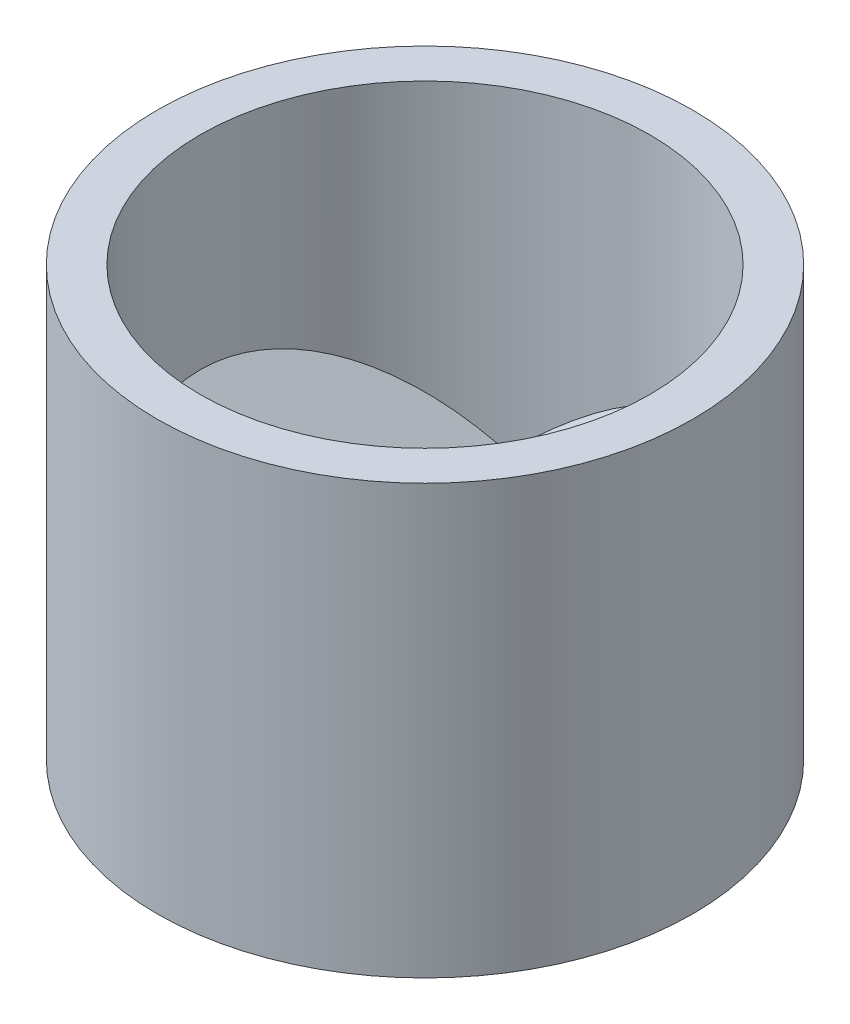
ISO-10303-21;
HEADER;
FILE_DESCRIPTION(('STEP AP214'),'2;1');
FILE_NAME('part.step','',(''),(''),'','','');
FILE_SCHEMA(('AUTOMOTIVE_DESIGN { 1 0 10303 214 1 1 1 1 }'));
ENDSEC;
DATA;
#1=APPLICATION_CONTEXT('core data for automotive mechanical design processes');
#2=APPLICATION_PROTOCOL_DEFINITION('international standard','automotive_design',2000,#1);
#3=PRODUCT_CONTEXT('',#1,'mechanical');
#4=PRODUCT('Part','Part','',(#3));
#5=PRODUCT_RELATED_PRODUCT_CATEGORY('part','',(#4));
#6=PRODUCT_DEFINITION_FORMATION('','',#4);
#7=PRODUCT_DEFINITION_CONTEXT('part definition',#1,'design');
#8=PRODUCT_DEFINITION('design','',#6,#7);
#9=PRODUCT_DEFINITION_SHAPE('','',#8);
#10=(LENGTH_UNIT() NAMED_UNIT(*) SI_UNIT(.MILLI.,.METRE.));
#11=(NAMED_UNIT(*) PLANE_ANGLE_UNIT() SI_UNIT($,.RADIAN.));
#12=(NAMED_UNIT(*) SI_UNIT($,.STERADIAN.) SOLID_ANGLE_UNIT());
#13=UNCERTAINTY_MEASURE_WITH_UNIT(LENGTH_MEASURE(1.E-05),#10,'distance_accuracy_value','');
#14=(GEOMETRIC_REPRESENTATION_CONTEXT(3) GLOBAL_UNCERTAINTY_ASSIGNED_CONTEXT((#13)) GLOBAL_UNIT_ASSIGNED_CONTEXT((#10,
#11,#12)) REPRESENTATION_CONTEXT('',''));
#15=CARTESIAN_POINT('',(0.,0.,0.));
#16=DIRECTION('',(0.,0.,1.));
#17=DIRECTION('',(1.,0.,0.));
#18=AXIS2_PLACEMENT_3D('',#15,#16,#17);
#19=CARTESIAN_POINT('',(0.,20.,0.));
#20=DIRECTION('',(0.,-1.,0.));
#21=DIRECTION('',(0.,0.,-1.));
#22=AXIS2_PLACEMENT_3D('',#19,#20,#21);
#23=CYLINDRICAL_SURFACE('',#22,10.5);
#24=CARTESIAN_POINT('',(0.,20.,0.));
#25=DIRECTION('',(0.,1.,0.));
#26=DIRECTION('',(0.,0.,1.));
#27=AXIS2_PLACEMENT_3D('',#24,#25,#26);
#28=CIRCLE('',#27,10.5);
#29=CARTESIAN_POINT('',(0.,20.,10.5));
#30=VERTEX_POINT('',#29);
#31=EDGE_CURVE('E175',#30,#30,#28,.T.);
#32=ORIENTED_EDGE('',*,*,#31,.T.);
#33=EDGE_LOOP('',(#32));
#34=FACE_BOUND('',#33,.T.);
#35=CARTESIAN_POINT('',(0.,0.,0.));
#36=DIRECTION('',(0.,1.,0.));
#37=DIRECTION('',(0.,0.,1.));
#38=AXIS2_PLACEMENT_3D('',#35,#36,#37);
#39=CIRCLE('',#38,10.5);
#40=CARTESIAN_POINT('',(0.,0.,10.5));
#41=VERTEX_POINT('',#40);
#42=EDGE_CURVE('E174',#41,#41,#39,.T.);
#43=ORIENTED_EDGE('',*,*,#42,.F.);
#44=EDGE_LOOP('',(#43));
#45=FACE_BOUND('',#44,.T.);
#46=CARTESIAN_POINT('',(0.,1.86967917205383,0.));
#47=DIRECTION('',(0.571705748774369,-0.571705748774363,-0.588476910028494));
#48=DIRECTION('',(-0.398371604811554,-0.820458735597559,0.410057956466548));
#49=AXIS2_PLACEMENT_3D('',#46,#47,#48);
#50=ELLIPSE('',#49,18.3660913372135,10.5);
#51=CARTESIAN_POINT('',(-6.05640258615646,4.6421890237833,-8.57729489491864));
#52=VERTEX_POINT('',#51);
#53=CARTESIAN_POINT('',(-5.52896641392532,5.52896641392526,-8.92639515110583));
#54=VERTEX_POINT('',#53);
#55=EDGE_CURVE('E198',#52,#54,#50,.T.);
#56=ORIENTED_EDGE('',*,*,#55,.F.);
#57=CARTESIAN_POINT('',(0.,-1.41421356237308,0.));
#58=DIRECTION('',(0.707106781186544,0.707106781186551,0.));
#59=DIRECTION('',(0.707106781186551,-0.707106781186544,0.));
#60=AXIS2_PLACEMENT_3D('',#57,#58,#59);
#61=ELLIPSE('',#60,14.8492424049174,10.5);
#62=CARTESIAN_POINT('',(-5.92794819003369,4.51373462766054,8.66656969372982));
#63=VERTEX_POINT('',#62);
#64=EDGE_CURVE('E202',#52,#63,#61,.T.);
#65=ORIENTED_EDGE('',*,*,#64,.T.);
#66=CARTESIAN_POINT('',(0.,1.86967917205384,0.));
#67=DIRECTION('',(0.57945014959109,-0.579450149591084,0.573127427609022));
#68=DIRECTION('',(-0.411974614062019,-0.815007683484561,-0.407479316321184));
#69=AXIS2_PLACEMENT_3D('',#66,#67,#68);
#70=ELLIPSE('',#69,18.120626955416,10.5);
#71=CARTESIAN_POINT('',(-5.39090392937529,5.39090392937524,9.01044698248905));
#72=VERTEX_POINT('',#71);
#73=EDGE_CURVE('E194',#72,#63,#70,.T.);
#74=ORIENTED_EDGE('',*,*,#73,.F.);
#75=CARTESIAN_POINT('',(0.,0.,0.));
#76=DIRECTION('',(0.707106781186544,0.707106781186551,0.));
#77=DIRECTION('',(0.707106781186551,-0.707106781186544,0.));
#78=AXIS2_PLACEMENT_3D('',#75,#76,#77);
#79=ELLIPSE('',#78,14.8492424049174,10.5);
#80=EDGE_CURVE('E187',#54,#72,#79,.T.);
#81=ORIENTED_EDGE('',*,*,#80,.F.);
#82=EDGE_LOOP('',(#56,#65,#74,#81));
#83=FACE_BOUND('',#82,.T.);
#84=CARTESIAN_POINT('',(0.,1.86967917205384,0.));
#85=DIRECTION('',(-0.79548882801243,-0.571705748774363,-0.200873246913957));
#86=DIRECTION('',(0.554306409729742,-0.820458735597559,0.139970951679904));
#87=AXIS2_PLACEMENT_3D('',#84,#85,#86);
#88=ELLIPSE('',#87,18.3660913372135,10.5);
#89=CARTESIAN_POINT('',(-4.39995398167185,4.6421890237833,9.5336459426166));
#90=VERTEX_POINT('',#89);
#91=CARTESIAN_POINT('',(-4.96600175811318,5.52896641392526,9.25142294668321));
#92=VERTEX_POINT('',#91);
#93=EDGE_CURVE('E213',#90,#92,#88,.T.);
#94=ORIENTED_EDGE('',*,*,#93,.F.);
#95=CARTESIAN_POINT('',(0.,-1.41421356237309,0.));
#96=DIRECTION('',(-0.353553390593275,0.707106781186551,-0.61237243569579));
#97=DIRECTION('',(-0.353553390593278,-0.707106781186544,-0.612372435695796));
#98=AXIS2_PLACEMENT_3D('',#95,#96,#97);
#99=ELLIPSE('',#98,14.8492424049174,10.5);
#100=CARTESIAN_POINT('',(10.4694436134552,4.51373462766054,0.800468878022201));
#101=VERTEX_POINT('',#100);
#102=EDGE_CURVE('E217',#90,#101,#99,.T.);
#103=ORIENTED_EDGE('',*,*,#102,.T.);
#104=CARTESIAN_POINT('',(0.,1.86967917205383,0.));
#105=DIRECTION('',(0.206617837119491,-0.579450149591084,-0.788382263577089));
#106=DIRECTION('',(-0.146900132419848,-0.815007683484561,0.560520139652591));
#107=AXIS2_PLACEMENT_3D('',#104,#105,#106);
#108=ELLIPSE('',#107,18.120626955416,10.5);
#109=CARTESIAN_POINT('',(10.498727950976,5.39090392937523,0.163436260955782));
#110=VERTEX_POINT('',#109);
#111=EDGE_CURVE('E209',#110,#101,#108,.T.);
#112=ORIENTED_EDGE('',*,*,#111,.F.);
#113=CARTESIAN_POINT('',(0.,0.,0.));
#114=DIRECTION('',(-0.353553390593275,0.707106781186551,-0.61237243569579));
#115=DIRECTION('',(-0.353553390593278,-0.707106781186544,-0.612372435695796));
#116=AXIS2_PLACEMENT_3D('',#113,#114,#115);
#117=ELLIPSE('',#116,14.8492424049174,10.5);
#118=EDGE_CURVE('E205',#92,#110,#117,.T.);
#119=ORIENTED_EDGE('',*,*,#118,.F.);
#120=EDGE_LOOP('',(#94,#103,#112,#119));
#121=FACE_BOUND('',#120,.T.);
#122=CARTESIAN_POINT('',(0.,1.86967917205383,0.));
#123=DIRECTION('',(0.223783079238068,-0.571705748774363,0.789350156942452));
#124=DIRECTION('',(-0.155934804918192,-0.820458735597559,-0.550028908146454));
#125=AXIS2_PLACEMENT_3D('',#122,#123,#124);
#126=ELLIPSE('',#125,18.3660913372135,10.5);
#127=CARTESIAN_POINT('',(10.4563565678283,4.64218902378331,-0.956351047698039));
#128=VERTEX_POINT('',#127);
#129=CARTESIAN_POINT('',(10.4949681720385,5.52896641392526,-0.325027795577455));
#130=VERTEX_POINT('',#129);
#131=EDGE_CURVE('E52',#128,#130,#126,.T.);
#132=ORIENTED_EDGE('',*,*,#131,.F.);
#133=CARTESIAN_POINT('',(0.,-1.41421356237308,0.));
#134=DIRECTION('',(-0.353553390593266,0.707106781186551,0.612372435695795));
#135=DIRECTION('',(-0.35355339059327,-0.707106781186544,0.612372435695801));
#136=AXIS2_PLACEMENT_3D('',#133,#134,#135);
#137=ELLIPSE('',#136,14.8492424049174,10.5);
#138=CARTESIAN_POINT('',(-4.54149542342159,4.51373462766054,-9.46703857175203));
#139=VERTEX_POINT('',#138);
#140=EDGE_CURVE('E11',#128,#139,#137,.T.);
#141=ORIENTED_EDGE('',*,*,#140,.T.);
#142=CARTESIAN_POINT('',(0.,1.86967917205383,0.));
#143=DIRECTION('',(-0.786067986710583,-0.579450149591084,0.215254835968073));
#144=DIRECTION('',(0.558874746481869,-0.815007683484561,-0.153040823331412));
#145=AXIS2_PLACEMENT_3D('',#142,#143,#144);
#146=ELLIPSE('',#145,18.120626955416,10.5);
#147=CARTESIAN_POINT('',(-5.1078240216008,5.39090392937524,-9.17388324344483));
#148=VERTEX_POINT('',#147);
#149=EDGE_CURVE('E116',#148,#139,#146,.T.);
#150=ORIENTED_EDGE('',*,*,#149,.F.);
#151=CARTESIAN_POINT('',(0.,0.,0.));
#152=DIRECTION('',(-0.353553390593266,0.707106781186551,0.612372435695795));
#153=DIRECTION('',(-0.35355339059327,-0.707106781186544,0.612372435695801));
#154=AXIS2_PLACEMENT_3D('',#151,#152,#153);
#155=ELLIPSE('',#154,14.8492424049174,10.5);
#156=EDGE_CURVE('E220',#130,#148,#155,.T.);
#157=ORIENTED_EDGE('',*,*,#156,.F.);
#158=EDGE_LOOP('',(#132,#141,#150,#157));
#159=FACE_BOUND('',#158,.T.);
#160=ADVANCED_FACE('F43',(#34,#45,#83,#121,#159),#23,.F.);
#161=CARTESIAN_POINT('',(0.,20.,0.));
#162=DIRECTION('',(0.,1.,0.));
#163=DIRECTION('',(0.,0.,1.));
#164=AXIS2_PLACEMENT_3D('',#161,#162,#163);
#165=PLANE('',#164);
#166=CARTESIAN_POINT('',(0.,20.,0.));
#167=DIRECTION('',(0.,1.,0.));
#168=DIRECTION('',(0.,0.,1.));
#169=AXIS2_PLACEMENT_3D('',#166,#167,#168);
#170=CIRCLE('',#169,12.5);
#171=CARTESIAN_POINT('',(0.,20.,12.5));
#172=VERTEX_POINT('',#171);
#173=EDGE_CURVE('E183',#172,#172,#170,.T.);
#174=ORIENTED_EDGE('',*,*,#173,.T.);
#175=EDGE_LOOP('',(#174));
#176=FACE_BOUND('',#175,.T.);
#177=ORIENTED_EDGE('',*,*,#31,.F.);
#178=EDGE_LOOP('',(#177));
#179=FACE_BOUND('',#178,.T.);
#180=ADVANCED_FACE('F229',(#176,#179),#165,.T.);
#181=CARTESIAN_POINT('',(0.,0.,0.));
#182=DIRECTION('',(0.,1.,0.));
#183=DIRECTION('',(0.,0.,1.));
#184=AXIS2_PLACEMENT_3D('',#181,#182,#183);
#185=PLANE('',#184);
#186=CARTESIAN_POINT('',(0.,0.,0.));
#187=DIRECTION('',(0.,1.,0.));
#188=DIRECTION('',(0.,0.,1.));
#189=AXIS2_PLACEMENT_3D('',#186,#187,#188);
#190=CIRCLE('',#189,12.5);
#191=CARTESIAN_POINT('',(0.,0.,12.5));
#192=VERTEX_POINT('',#191);
#193=EDGE_CURVE('E179',#192,#192,#190,.T.);
#194=ORIENTED_EDGE('',*,*,#193,.F.);
#195=EDGE_LOOP('',(#194));
#196=FACE_BOUND('',#195,.T.);
#197=ORIENTED_EDGE('',*,*,#42,.T.);
#198=EDGE_LOOP('',(#197));
#199=FACE_BOUND('',#198,.T.);
#200=ADVANCED_FACE('F235',(#196,#199),#185,.F.);
#201=CARTESIAN_POINT('',(0.,20.,0.));
#202=DIRECTION('',(0.,-1.,0.));
#203=DIRECTION('',(0.,0.,-1.));
#204=AXIS2_PLACEMENT_3D('',#201,#202,#203);
#205=CYLINDRICAL_SURFACE('',#204,12.5);
#206=ORIENTED_EDGE('',*,*,#173,.F.);
#207=EDGE_LOOP('',(#206));
#208=FACE_BOUND('',#207,.T.);
#209=ORIENTED_EDGE('',*,*,#193,.T.);
#210=EDGE_LOOP('',(#209));
#211=FACE_BOUND('',#210,.T.);
#212=ADVANCED_FACE('F45',(#208,#211),#205,.T.);
#213=CARTESIAN_POINT('',(-6.46099192408462,5.04677836171147,-9.36341257071716));
#214=DIRECTION('',(0.571705748774369,-0.571705748774363,-0.588476910028494));
#215=DIRECTION('',(-0.717253512572929,0.,-0.696812312392508));
#216=AXIS2_PLACEMENT_3D('',#213,#214,#215);
#217=PLANE('',#216);
#218=DIRECTION('',(-0.416116013652856,0.416116013652851,-0.808514023603373));
#219=VECTOR('',#218,1.);
#220=CARTESIAN_POINT('',(-6.46099192408462,5.04677836171147,-9.36341257071716));
#221=LINE('',#220,#219);
#222=CARTESIAN_POINT('',(-1.64194636721346,0.227732804840355,0.));
#223=VERTEX_POINT('',#222);
#224=EDGE_CURVE('E160',#223,#52,#221,.T.);
#225=ORIENTED_EDGE('',*,*,#224,.T.);
#226=ORIENTED_EDGE('',*,*,#55,.T.);
#227=DIRECTION('',(-0.416116013652856,0.416116013652851,-0.808514023603373));
#228=VECTOR('',#227,1.);
#229=CARTESIAN_POINT('',(-5.75388514289808,5.75388514289802,-9.36341257071716));
#230=LINE('',#229,#228);
#231=CARTESIAN_POINT('',(-0.934839586026916,0.934839586026906,0.));
#232=VERTEX_POINT('',#231);
#233=EDGE_CURVE('E161',#232,#54,#230,.T.);
#234=ORIENTED_EDGE('',*,*,#233,.F.);
#235=DIRECTION('',(0.707106781186544,0.707106781186551,0.));
#236=VECTOR('',#235,1.);
#237=CARTESIAN_POINT('',(-1.64194636721346,0.227732804840355,0.));
#238=LINE('',#237,#236);
#239=EDGE_CURVE('E165',#223,#232,#238,.T.);
#240=ORIENTED_EDGE('',*,*,#239,.F.);
#241=EDGE_LOOP('',(#225,#226,#234,#240));
#242=FACE_BOUND('',#241,.T.);
#243=ADVANCED_FACE('F247',(#242),#217,.T.);
#244=CARTESIAN_POINT('',(-1.64194636721346,0.227732804840355,0.));
#245=DIRECTION('',(0.57945014959109,-0.579450149591084,0.573127427609022));
#246=DIRECTION('',(0.707106781186544,0.707106781186551,0.));
#247=AXIS2_PLACEMENT_3D('',#244,#245,#246);
#248=PLANE('',#247);
#249=DIRECTION('',(0.405262290546344,-0.405262290546339,-0.819466260270833));
#250=VECTOR('',#249,1.);
#251=CARTESIAN_POINT('',(-0.934839586026916,0.934839586026906,0.));
#252=LINE('',#251,#250);
#253=EDGE_CURVE('E156',#72,#232,#252,.T.);
#254=ORIENTED_EDGE('',*,*,#253,.F.);
#255=ORIENTED_EDGE('',*,*,#73,.T.);
#256=DIRECTION('',(0.405262290546344,-0.405262290546339,-0.819466260270833));
#257=VECTOR('',#256,1.);
#258=CARTESIAN_POINT('',(-1.64194636721346,0.227732804840355,0.));
#259=LINE('',#258,#257);
#260=EDGE_CURVE('E157',#63,#223,#259,.T.);
#261=ORIENTED_EDGE('',*,*,#260,.T.);
#262=ORIENTED_EDGE('',*,*,#239,.T.);
#263=EDGE_LOOP('',(#254,#255,#261,#262));
#264=FACE_BOUND('',#263,.T.);
#265=ADVANCED_FACE('F240',(#264),#248,.T.);
#266=CARTESIAN_POINT('',(-5.10910373303163,3.69489017065849,0.0855611500332861));
#267=DIRECTION('',(0.707106781186544,0.707106781186551,0.));
#268=DIRECTION('',(-0.707106781186551,0.707106781186544,0.));
#269=AXIS2_PLACEMENT_3D('',#266,#267,#268);
#270=PLANE('',#269);
#271=ORIENTED_EDGE('',*,*,#64,.F.);
#272=ORIENTED_EDGE('',*,*,#224,.F.);
#273=ORIENTED_EDGE('',*,*,#260,.F.);
#274=EDGE_LOOP('',(#271,#272,#273));
#275=FACE_BOUND('',#274,.T.);
#276=ADVANCED_FACE('F284',(#275),#270,.F.);
#277=CARTESIAN_POINT('',(-4.40199695184508,4.40199695184504,0.0855611500332861));
#278=DIRECTION('',(0.707106781186544,0.707106781186551,0.));
#279=DIRECTION('',(-0.707106781186551,0.707106781186544,0.));
#280=AXIS2_PLACEMENT_3D('',#277,#278,#279);
#281=PLANE('',#280);
#282=ORIENTED_EDGE('',*,*,#233,.T.);
#283=ORIENTED_EDGE('',*,*,#80,.T.);
#284=ORIENTED_EDGE('',*,*,#253,.T.);
#285=EDGE_LOOP('',(#282,#283,#284));
#286=FACE_BOUND('',#285,.T.);
#287=ADVANCED_FACE('F281',(#286),#281,.T.);
#288=CARTESIAN_POINT('',(-4.87845719031326,5.04677836171147,10.277089425262));
#289=DIRECTION('',(-0.79548882801243,-0.571705748774363,-0.200873246913957));
#290=DIRECTION('',(0.583601150432407,-0.812040452941829,0.));
#291=AXIS2_PLACEMENT_3D('',#288,#289,#290);
#292=PLANE('',#291);
#293=DIRECTION('',(-0.492135676930061,0.416116013652851,0.764624050546575));
#294=VECTOR('',#293,1.);
#295=CARTESIAN_POINT('',(-4.87845719031326,5.04677836171147,10.277089425262));
#296=LINE('',#295,#294);
#297=CARTESIAN_POINT('',(0.820973183606737,0.227732804840355,1.42196726565843));
#298=VERTEX_POINT('',#297);
#299=EDGE_CURVE('E142',#298,#90,#296,.T.);
#300=ORIENTED_EDGE('',*,*,#299,.T.);
#301=ORIENTED_EDGE('',*,*,#93,.T.);
#302=DIRECTION('',(-0.492135676930061,0.416116013652851,0.764624050546575));
#303=VECTOR('',#302,1.);
#304=CARTESIAN_POINT('',(-5.23201058090653,5.75388514289802,9.66471698956619));
#305=LINE('',#304,#303);
#306=CARTESIAN_POINT('',(0.467419793013462,0.934839586026906,0.809594829962635));
#307=VERTEX_POINT('',#306);
#308=EDGE_CURVE('E143',#307,#92,#305,.T.);
#309=ORIENTED_EDGE('',*,*,#308,.F.);
#310=DIRECTION('',(-0.353553390593275,0.707106781186551,-0.61237243569579));
#311=VECTOR('',#310,1.);
#312=CARTESIAN_POINT('',(0.820973183606737,0.227732804840355,1.42196726565843));
#313=LINE('',#312,#311);
#314=EDGE_CURVE('E147',#298,#307,#313,.T.);
#315=ORIENTED_EDGE('',*,*,#314,.F.);
#316=EDGE_LOOP('',(#300,#301,#309,#315));
#317=FACE_BOUND('',#316,.T.);
#318=ADVANCED_FACE('F263',(#317),#292,.T.);
#319=CARTESIAN_POINT('',(0.820973183606737,0.227732804840355,1.42196726565843));
#320=DIRECTION('',(0.206617837119491,-0.579450149591084,-0.788382263577089));
#321=DIRECTION('',(0.,0.805769377856443,-0.592229440089599));
#322=AXIS2_PLACEMENT_3D('',#319,#320,#321);
#323=PLANE('',#322);
#324=DIRECTION('',(-0.912309744211944,-0.405262290546339,0.0587656913264173));
#325=VECTOR('',#324,1.);
#326=CARTESIAN_POINT('',(0.467419793013462,0.934839586026906,0.809594829962635));
#327=LINE('',#326,#325);
#328=EDGE_CURVE('E128',#110,#307,#327,.T.);
#329=ORIENTED_EDGE('',*,*,#328,.F.);
#330=ORIENTED_EDGE('',*,*,#111,.T.);
#331=DIRECTION('',(-0.912309744211944,-0.405262290546339,0.0587656913264173));
#332=VECTOR('',#331,1.);
#333=CARTESIAN_POINT('',(0.820973183606737,0.227732804840355,1.42196726565843));
#334=LINE('',#333,#332);
#335=EDGE_CURVE('E139',#101,#298,#334,.T.);
#336=ORIENTED_EDGE('',*,*,#335,.T.);
#337=ORIENTED_EDGE('',*,*,#314,.T.);
#338=EDGE_LOOP('',(#329,#330,#336,#337));
#339=FACE_BOUND('',#338,.T.);
#340=ADVANCED_FACE('F266',(#339),#323,.T.);
#341=CARTESIAN_POINT('',(2.62864999602167,3.69489017065849,4.38183304835865));
#342=DIRECTION('',(-0.353553390593275,0.707106781186551,-0.61237243569579));
#343=DIRECTION('',(0.353553390593279,0.707106781186544,0.612372435695796));
#344=AXIS2_PLACEMENT_3D('',#341,#342,#343);
#345=PLANE('',#344);
#346=ORIENTED_EDGE('',*,*,#102,.F.);
#347=ORIENTED_EDGE('',*,*,#299,.F.);
#348=ORIENTED_EDGE('',*,*,#335,.F.);
#349=EDGE_LOOP('',(#346,#347,#348));
#350=FACE_BOUND('',#349,.T.);
#351=ADVANCED_FACE('F261',(#350),#345,.F.);
#352=CARTESIAN_POINT('',(2.2750966054284,4.40199695184504,3.76946061266286));
#353=DIRECTION('',(-0.353553390593275,0.707106781186551,-0.61237243569579));
#354=DIRECTION('',(0.353553390593279,0.707106781186544,0.612372435695796));
#355=AXIS2_PLACEMENT_3D('',#352,#353,#354);
#356=PLANE('',#355);
#357=ORIENTED_EDGE('',*,*,#308,.T.);
#358=ORIENTED_EDGE('',*,*,#118,.T.);
#359=ORIENTED_EDGE('',*,*,#328,.T.);
#360=EDGE_LOOP('',(#357,#358,#359));
#361=FACE_BOUND('',#360,.T.);
#362=ADVANCED_FACE('F268',(#361),#356,.T.);
#363=CARTESIAN_POINT('',(11.3394491143979,5.04677836171147,-0.913676854544908));
#364=DIRECTION('',(0.223783079238068,-0.571705748774363,0.789350156942452));
#365=DIRECTION('',(0.,-0.809889791418018,-0.586582070776869));
#366=AXIS2_PLACEMENT_3D('',#363,#364,#365);
#367=PLANE('',#366);
#368=DIRECTION('',(0.908251690582921,0.416116013652851,0.0438899730567928));
#369=VECTOR('',#368,1.);
#370=CARTESIAN_POINT('',(11.3394491143979,5.04677836171147,-0.913676854544908));
#371=LINE('',#370,#369);
#372=CARTESIAN_POINT('',(0.820973183606717,0.227732804840355,-1.42196726565844));
#373=VERTEX_POINT('',#372);
#374=EDGE_CURVE('E120',#373,#128,#371,.T.);
#375=ORIENTED_EDGE('',*,*,#374,.T.);
#376=ORIENTED_EDGE('',*,*,#131,.T.);
#377=DIRECTION('',(0.908251690582921,0.416116013652851,0.0438899730567928));
#378=VECTOR('',#377,1.);
#379=CARTESIAN_POINT('',(10.9858957238046,5.75388514289802,-0.301304418849114));
#380=LINE('',#379,#378);
#381=CARTESIAN_POINT('',(0.467419793013451,0.934839586026906,-0.809594829962642));
#382=VERTEX_POINT('',#381);
#383=EDGE_CURVE('E121',#382,#130,#380,.T.);
#384=ORIENTED_EDGE('',*,*,#383,.F.);
#385=DIRECTION('',(-0.353553390593266,0.707106781186551,0.612372435695795));
#386=VECTOR('',#385,1.);
#387=CARTESIAN_POINT('',(0.820973183606717,0.227732804840355,-1.42196726565844));
#388=LINE('',#387,#386);
#389=EDGE_CURVE('E114',#373,#382,#388,.T.);
#390=ORIENTED_EDGE('',*,*,#389,.F.);
#391=EDGE_LOOP('',(#375,#376,#384,#390));
#392=FACE_BOUND('',#391,.T.);
#393=ADVANCED_FACE('F125',(#392),#367,.T.);
#394=CARTESIAN_POINT('',(0.820973183606717,0.227732804840355,-1.42196726565844));
#395=DIRECTION('',(-0.786067986710583,-0.579450149591084,0.215254835968073));
#396=DIRECTION('',(0.593359740819883,-0.804937400034413,0.));
#397=AXIS2_PLACEMENT_3D('',#394,#395,#396);
#398=PLANE('',#397);
#399=DIRECTION('',(0.507047453665608,-0.405262290546339,0.760700568944416));
#400=VECTOR('',#399,1.);
#401=CARTESIAN_POINT('',(0.467419793013451,0.934839586026906,-0.809594829962642));
#402=LINE('',#401,#400);
#403=EDGE_CURVE('E134',#148,#382,#402,.T.);
#404=ORIENTED_EDGE('',*,*,#403,.F.);
#405=ORIENTED_EDGE('',*,*,#149,.T.);
#406=DIRECTION('',(0.507047453665608,-0.405262290546339,0.760700568944416));
#407=VECTOR('',#406,1.);
#408=CARTESIAN_POINT('',(0.820973183606717,0.227732804840355,-1.42196726565844));
#409=LINE('',#408,#407);
#410=EDGE_CURVE('E110',#139,#373,#409,.T.);
#411=ORIENTED_EDGE('',*,*,#410,.T.);
#412=ORIENTED_EDGE('',*,*,#389,.T.);
#413=EDGE_LOOP('',(#404,#405,#411,#412));
#414=FACE_BOUND('',#413,.T.);
#415=ADVANCED_FACE('F113',(#414),#398,.T.);
#416=CARTESIAN_POINT('',(2.48045373700994,3.69489017065849,-4.46739419839197));
#417=DIRECTION('',(-0.353553390593266,0.707106781186551,0.612372435695795));
#418=DIRECTION('',(0.35355339059327,0.707106781186544,-0.612372435695801));
#419=AXIS2_PLACEMENT_3D('',#416,#417,#418);
#420=PLANE('',#419);
#421=ORIENTED_EDGE('',*,*,#140,.F.);
#422=ORIENTED_EDGE('',*,*,#374,.F.);
#423=ORIENTED_EDGE('',*,*,#410,.F.);
#424=EDGE_LOOP('',(#421,#422,#423));
#425=FACE_BOUND('',#424,.T.);
#426=ADVANCED_FACE('F130',(#425),#420,.F.);
#427=CARTESIAN_POINT('',(2.12690034641667,4.40199695184504,-3.85502176269617));
#428=DIRECTION('',(-0.353553390593266,0.707106781186551,0.612372435695795));
#429=DIRECTION('',(0.35355339059327,0.707106781186544,-0.612372435695801));
#430=AXIS2_PLACEMENT_3D('',#427,#428,#429);
#431=PLANE('',#430);
#432=ORIENTED_EDGE('',*,*,#383,.T.);
#433=ORIENTED_EDGE('',*,*,#156,.T.);
#434=ORIENTED_EDGE('',*,*,#403,.T.);
#435=EDGE_LOOP('',(#432,#433,#434));
#436=FACE_BOUND('',#435,.T.);
#437=ADVANCED_FACE('F227',(#436),#431,.T.);
#438=CLOSED_SHELL('',(#160,#180,#200,#212,#243,#265,#276,#287,#318,#340,#351,#362,#393,#415,
#426,#437));
#439=MANIFOLD_SOLID_BREP('B2',#438);
#440=ADVANCED_BREP_SHAPE_REPRESENTATION('',(#18,#439),#14);
#441=SHAPE_DEFINITION_REPRESENTATION(#9,#440);
ENDSEC;
END-ISO-10303-21;
